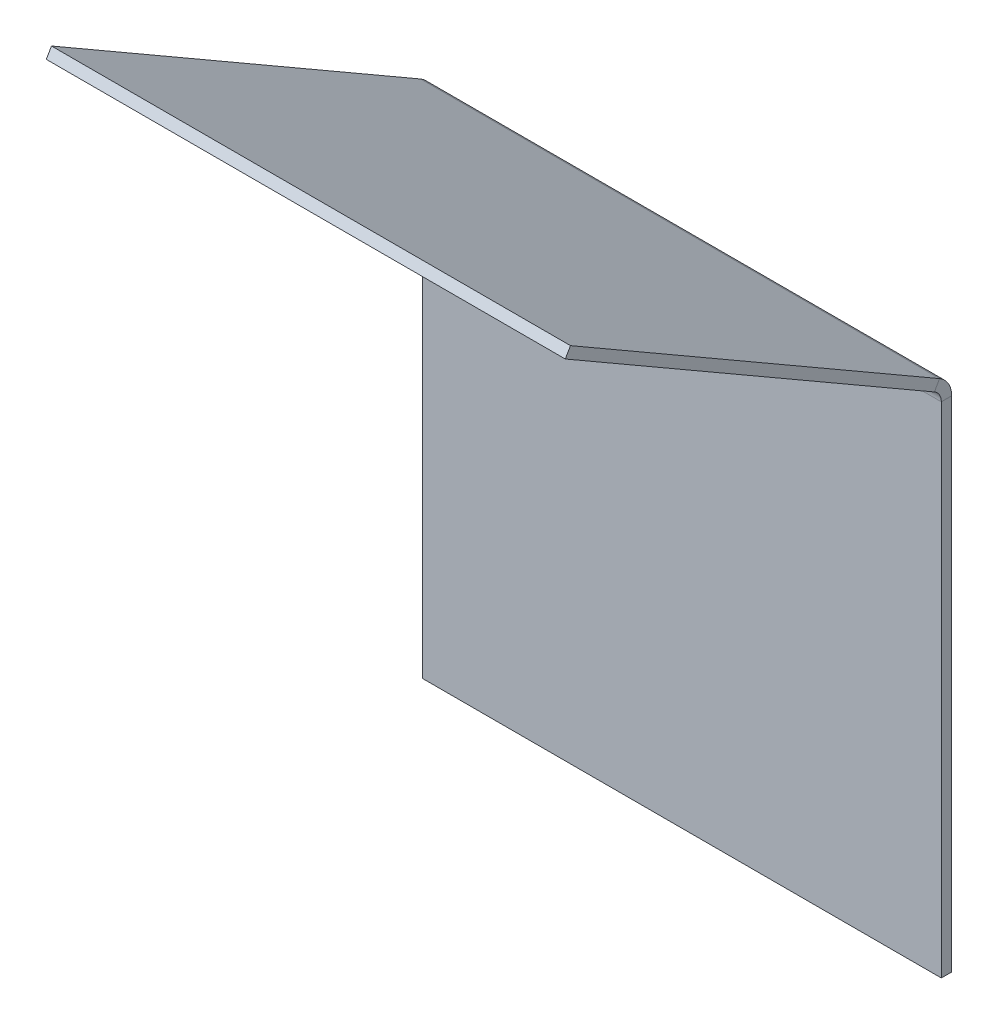
ISO-10303-21;
HEADER;
FILE_DESCRIPTION(('STEP AP214'),'2;1');
FILE_NAME('part.step','',(''),(''),'','','');
FILE_SCHEMA(('AUTOMOTIVE_DESIGN { 1 0 10303 214 1 1 1 1 }'));
ENDSEC;
DATA;
#1=APPLICATION_CONTEXT('core data for automotive mechanical design processes');
#2=APPLICATION_PROTOCOL_DEFINITION('international standard','automotive_design',2000,#1);
#3=PRODUCT_CONTEXT('',#1,'mechanical');
#4=PRODUCT('Part','Part','',(#3));
#5=PRODUCT_RELATED_PRODUCT_CATEGORY('part','',(#4));
#6=PRODUCT_DEFINITION_FORMATION('','',#4);
#7=PRODUCT_DEFINITION_CONTEXT('part definition',#1,'design');
#8=PRODUCT_DEFINITION('design','',#6,#7);
#9=PRODUCT_DEFINITION_SHAPE('','',#8);
#10=(LENGTH_UNIT() NAMED_UNIT(*) SI_UNIT(.MILLI.,.METRE.));
#11=(NAMED_UNIT(*) PLANE_ANGLE_UNIT() SI_UNIT($,.RADIAN.));
#12=(NAMED_UNIT(*) SI_UNIT($,.STERADIAN.) SOLID_ANGLE_UNIT());
#13=UNCERTAINTY_MEASURE_WITH_UNIT(LENGTH_MEASURE(1.E-05),#10,'distance_accuracy_value','');
#14=(GEOMETRIC_REPRESENTATION_CONTEXT(3) GLOBAL_UNCERTAINTY_ASSIGNED_CONTEXT((#13)) GLOBAL_UNIT_ASSIGNED_CONTEXT((#10,
#11,#12)) REPRESENTATION_CONTEXT('',''));
#15=CARTESIAN_POINT('',(0.,0.,0.));
#16=DIRECTION('',(0.,0.,1.));
#17=DIRECTION('',(1.,0.,0.));
#18=AXIS2_PLACEMENT_3D('',#15,#16,#17);
#19=CARTESIAN_POINT('',(-75.,-75.,-3.));
#20=DIRECTION('',(-1.,0.,0.));
#21=DIRECTION('',(0.,0.,1.));
#22=AXIS2_PLACEMENT_3D('',#19,#20,#21);
#23=PLANE('',#22);
#24=DIRECTION('',(0.,-1.,0.));
#25=VECTOR('',#24,1.);
#26=CARTESIAN_POINT('',(-75.,-75.,0.));
#27=LINE('',#26,#25);
#28=CARTESIAN_POINT('',(-75.,69.2264973081038,0.));
#29=VERTEX_POINT('',#28);
#30=CARTESIAN_POINT('',(-75.,-75.,0.));
#31=VERTEX_POINT('',#30);
#32=EDGE_CURVE('E105',#29,#31,#27,.T.);
#33=ORIENTED_EDGE('',*,*,#32,.F.);
#34=DIRECTION('',(0.,0.,-1.));
#35=VECTOR('',#34,1.);
#36=CARTESIAN_POINT('',(-75.,69.2264973081038,0.));
#37=LINE('',#36,#35);
#38=CARTESIAN_POINT('',(-75.,69.2264973081038,-3.00000000000001));
#39=VERTEX_POINT('',#38);
#40=EDGE_CURVE('E114',#29,#39,#37,.T.);
#41=ORIENTED_EDGE('',*,*,#40,.T.);
#42=DIRECTION('',(0.,-1.,0.));
#43=VECTOR('',#42,1.);
#44=CARTESIAN_POINT('',(-75.,-75.,-3.));
#45=LINE('',#44,#43);
#46=CARTESIAN_POINT('',(-75.,-75.,-3.));
#47=VERTEX_POINT('',#46);
#48=EDGE_CURVE('E102',#39,#47,#45,.T.);
#49=ORIENTED_EDGE('',*,*,#48,.T.);
#50=DIRECTION('',(0.,0.,1.));
#51=VECTOR('',#50,1.);
#52=CARTESIAN_POINT('',(-75.,-75.,-3.));
#53=LINE('',#52,#51);
#54=EDGE_CURVE('E60',#47,#31,#53,.T.);
#55=ORIENTED_EDGE('',*,*,#54,.T.);
#56=EDGE_LOOP('',(#33,#41,#49,#55));
#57=FACE_BOUND('',#56,.T.);
#58=ADVANCED_FACE('F57',(#57),#23,.T.);
#59=CARTESIAN_POINT('',(0.,0.,-3.));
#60=DIRECTION('',(0.,0.,1.));
#61=DIRECTION('',(1.,0.,0.));
#62=AXIS2_PLACEMENT_3D('',#59,#60,#61);
#63=PLANE('',#62);
#64=DIRECTION('',(-1.,0.,0.));
#65=VECTOR('',#64,1.);
#66=CARTESIAN_POINT('',(-75.,69.2264973081038,-3.00000000000001));
#67=LINE('',#66,#65);
#68=CARTESIAN_POINT('',(75.,69.2264973081038,-3.));
#69=VERTEX_POINT('',#68);
#70=EDGE_CURVE('E130',#39,#69,#67,.F.);
#71=ORIENTED_EDGE('',*,*,#70,.T.);
#72=DIRECTION('',(0.,1.,0.));
#73=VECTOR('',#72,1.);
#74=CARTESIAN_POINT('',(75.,-75.,-3.));
#75=LINE('',#74,#73);
#76=CARTESIAN_POINT('',(75.,-75.,-3.));
#77=VERTEX_POINT('',#76);
#78=EDGE_CURVE('E110',#77,#69,#75,.T.);
#79=ORIENTED_EDGE('',*,*,#78,.F.);
#80=DIRECTION('',(1.,0.,0.));
#81=VECTOR('',#80,1.);
#82=CARTESIAN_POINT('',(75.,-75.,-3.));
#83=LINE('',#82,#81);
#84=EDGE_CURVE('E95',#47,#77,#83,.T.);
#85=ORIENTED_EDGE('',*,*,#84,.F.);
#86=ORIENTED_EDGE('',*,*,#48,.F.);
#87=EDGE_LOOP('',(#71,#79,#85,#86));
#88=FACE_BOUND('',#87,.T.);
#89=ADVANCED_FACE('F208',(#88),#63,.F.);
#90=CARTESIAN_POINT('',(0.,0.,0.));
#91=DIRECTION('',(0.,0.,1.));
#92=DIRECTION('',(1.,0.,0.));
#93=AXIS2_PLACEMENT_3D('',#90,#91,#92);
#94=PLANE('',#93);
#95=DIRECTION('',(0.,1.,0.));
#96=VECTOR('',#95,1.);
#97=CARTESIAN_POINT('',(75.,-75.,0.));
#98=LINE('',#97,#96);
#99=CARTESIAN_POINT('',(75.,-75.,0.));
#100=VERTEX_POINT('',#99);
#101=CARTESIAN_POINT('',(75.,69.2264973081038,0.));
#102=VERTEX_POINT('',#101);
#103=EDGE_CURVE('E97',#100,#102,#98,.T.);
#104=ORIENTED_EDGE('',*,*,#103,.T.);
#105=DIRECTION('',(-1.,0.,0.));
#106=VECTOR('',#105,1.);
#107=CARTESIAN_POINT('',(-75.,69.2264973081038,0.));
#108=LINE('',#107,#106);
#109=EDGE_CURVE('E71',#29,#102,#108,.F.);
#110=ORIENTED_EDGE('',*,*,#109,.F.);
#111=ORIENTED_EDGE('',*,*,#32,.T.);
#112=DIRECTION('',(1.,0.,0.));
#113=VECTOR('',#112,1.);
#114=CARTESIAN_POINT('',(75.,-75.,0.));
#115=LINE('',#114,#113);
#116=EDGE_CURVE('E93',#31,#100,#115,.T.);
#117=ORIENTED_EDGE('',*,*,#116,.T.);
#118=EDGE_LOOP('',(#104,#110,#111,#117));
#119=FACE_BOUND('',#118,.T.);
#120=ADVANCED_FACE('F104',(#119),#94,.T.);
#121=CARTESIAN_POINT('',(75.,-75.,-3.));
#122=DIRECTION('',(1.,0.,0.));
#123=DIRECTION('',(0.,0.,-1.));
#124=AXIS2_PLACEMENT_3D('',#121,#122,#123);
#125=PLANE('',#124);
#126=DIRECTION('',(0.,0.,-1.));
#127=VECTOR('',#126,1.);
#128=CARTESIAN_POINT('',(75.,69.2264973081038,0.));
#129=LINE('',#128,#127);
#130=EDGE_CURVE('E101',#102,#69,#129,.T.);
#131=ORIENTED_EDGE('',*,*,#130,.F.);
#132=ORIENTED_EDGE('',*,*,#103,.F.);
#133=DIRECTION('',(0.,0.,1.));
#134=VECTOR('',#133,1.);
#135=CARTESIAN_POINT('',(75.,-75.,-3.));
#136=LINE('',#135,#134);
#137=EDGE_CURVE('E13',#77,#100,#136,.T.);
#138=ORIENTED_EDGE('',*,*,#137,.F.);
#139=ORIENTED_EDGE('',*,*,#78,.T.);
#140=EDGE_LOOP('',(#131,#132,#138,#139));
#141=FACE_BOUND('',#140,.T.);
#142=ADVANCED_FACE('F98',(#141),#125,.T.);
#143=CARTESIAN_POINT('',(75.,-75.,-3.));
#144=DIRECTION('',(0.,-1.,0.));
#145=DIRECTION('',(1.,0.,0.));
#146=AXIS2_PLACEMENT_3D('',#143,#144,#145);
#147=PLANE('',#146);
#148=ORIENTED_EDGE('',*,*,#116,.F.);
#149=ORIENTED_EDGE('',*,*,#54,.F.);
#150=ORIENTED_EDGE('',*,*,#84,.T.);
#151=ORIENTED_EDGE('',*,*,#137,.T.);
#152=EDGE_LOOP('',(#148,#149,#150,#151));
#153=FACE_BOUND('',#152,.T.);
#154=ADVANCED_FACE('F90',(#153),#147,.T.);
#155=CARTESIAN_POINT('',(75.,69.2264973081038,3.99999999999998));
#156=DIRECTION('',(1.,0.,0.));
#157=DIRECTION('',(0.,0.,-1.));
#158=AXIS2_PLACEMENT_3D('',#155,#156,#157);
#159=PLANE('',#158);
#160=DIRECTION('',(0.,-0.866025403784436,0.500000000000004));
#161=VECTOR('',#160,1.);
#162=CARTESIAN_POINT('',(75.,75.2886751345948,0.499999999999972));
#163=LINE('',#162,#161);
#164=CARTESIAN_POINT('',(75.,72.6905989232415,1.99999999999997));
#165=VERTEX_POINT('',#164);
#166=CARTESIAN_POINT('',(75.,75.2886751345948,0.499999999999956));
#167=VERTEX_POINT('',#166);
#168=EDGE_CURVE('E135',#165,#167,#163,.F.);
#169=ORIENTED_EDGE('',*,*,#168,.F.);
#170=CARTESIAN_POINT('',(75.,69.2264973081038,3.99999999999998));
#171=DIRECTION('',(-1.,0.,0.));
#172=DIRECTION('',(0.,0.,1.));
#173=AXIS2_PLACEMENT_3D('',#170,#171,#172);
#174=CIRCLE('',#173,3.99999999999999);
#175=EDGE_CURVE('E124',#102,#165,#174,.F.);
#176=ORIENTED_EDGE('',*,*,#175,.F.);
#177=ORIENTED_EDGE('',*,*,#130,.T.);
#178=CARTESIAN_POINT('',(75.,69.2264973081038,3.99999999999998));
#179=DIRECTION('',(-1.,0.,0.));
#180=DIRECTION('',(0.,0.,1.));
#181=AXIS2_PLACEMENT_3D('',#178,#179,#180);
#182=CIRCLE('',#181,6.99999999999999);
#183=EDGE_CURVE('E117',#69,#167,#182,.F.);
#184=ORIENTED_EDGE('',*,*,#183,.T.);
#185=EDGE_LOOP('',(#169,#176,#177,#184));
#186=FACE_BOUND('',#185,.T.);
#187=ADVANCED_FACE('F212',(#186),#159,.T.);
#188=CARTESIAN_POINT('',(-75.,69.2264973081038,3.99999999999998));
#189=DIRECTION('',(1.,0.,0.));
#190=DIRECTION('',(0.,0.,-1.));
#191=AXIS2_PLACEMENT_3D('',#188,#189,#190);
#192=PLANE('',#191);
#193=CARTESIAN_POINT('',(-75.,69.2264973081038,3.99999999999998));
#194=DIRECTION('',(-1.,0.,0.));
#195=DIRECTION('',(0.,0.,1.));
#196=AXIS2_PLACEMENT_3D('',#193,#194,#195);
#197=CIRCLE('',#196,3.99999999999999);
#198=CARTESIAN_POINT('',(-75.,72.6905989232415,1.99999999999997));
#199=VERTEX_POINT('',#198);
#200=EDGE_CURVE('E119',#199,#29,#197,.T.);
#201=ORIENTED_EDGE('',*,*,#200,.F.);
#202=DIRECTION('',(0.,-0.866025403784436,0.500000000000004));
#203=VECTOR('',#202,1.);
#204=CARTESIAN_POINT('',(-75.,72.6905989232415,2.));
#205=LINE('',#204,#203);
#206=CARTESIAN_POINT('',(-75.,75.2886751345948,0.49999999999996));
#207=VERTEX_POINT('',#206);
#208=EDGE_CURVE('E141',#199,#207,#205,.F.);
#209=ORIENTED_EDGE('',*,*,#208,.T.);
#210=CARTESIAN_POINT('',(-75.,69.2264973081038,3.99999999999998));
#211=DIRECTION('',(-1.,0.,0.));
#212=DIRECTION('',(0.,0.,1.));
#213=AXIS2_PLACEMENT_3D('',#210,#211,#212);
#214=CIRCLE('',#213,6.99999999999999);
#215=EDGE_CURVE('E127',#207,#39,#214,.T.);
#216=ORIENTED_EDGE('',*,*,#215,.T.);
#217=ORIENTED_EDGE('',*,*,#40,.F.);
#218=EDGE_LOOP('',(#201,#209,#216,#217));
#219=FACE_BOUND('',#218,.T.);
#220=ADVANCED_FACE('F222',(#219),#192,.F.);
#221=CARTESIAN_POINT('',(-75.,69.2264973081038,3.99999999999998));
#222=DIRECTION('',(-1.,0.,0.));
#223=DIRECTION('',(0.,0.866025403784436,-0.500000000000004));
#224=AXIS2_PLACEMENT_3D('',#221,#222,#223);
#225=CYLINDRICAL_SURFACE('',#224,6.99999999999999);
#226=ORIENTED_EDGE('',*,*,#70,.F.);
#227=ORIENTED_EDGE('',*,*,#215,.F.);
#228=DIRECTION('',(-1.,0.,0.));
#229=VECTOR('',#228,1.);
#230=CARTESIAN_POINT('',(75.,75.2886751345948,0.499999999999962));
#231=LINE('',#230,#229);
#232=EDGE_CURVE('E144',#207,#167,#231,.F.);
#233=ORIENTED_EDGE('',*,*,#232,.T.);
#234=ORIENTED_EDGE('',*,*,#183,.F.);
#235=EDGE_LOOP('',(#226,#227,#233,#234));
#236=FACE_BOUND('',#235,.T.);
#237=ADVANCED_FACE('F213',(#236),#225,.T.);
#238=CARTESIAN_POINT('',(-75.,69.2264973081038,3.99999999999998));
#239=DIRECTION('',(-1.,0.,0.));
#240=DIRECTION('',(0.,0.866025403784436,-0.500000000000004));
#241=AXIS2_PLACEMENT_3D('',#238,#239,#240);
#242=CYLINDRICAL_SURFACE('',#241,3.99999999999999);
#243=ORIENTED_EDGE('',*,*,#109,.T.);
#244=ORIENTED_EDGE('',*,*,#175,.T.);
#245=DIRECTION('',(-1.,0.,0.));
#246=VECTOR('',#245,1.);
#247=CARTESIAN_POINT('',(75.,72.6905989232415,1.99999999999997));
#248=LINE('',#247,#246);
#249=EDGE_CURVE('E138',#165,#199,#248,.T.);
#250=ORIENTED_EDGE('',*,*,#249,.T.);
#251=ORIENTED_EDGE('',*,*,#200,.T.);
#252=EDGE_LOOP('',(#243,#244,#250,#251));
#253=FACE_BOUND('',#252,.T.);
#254=ADVANCED_FACE('F225',(#253),#242,.F.);
#255=CARTESIAN_POINT('',(75.,74.1339745962155,-1.50000000000001));
#256=DIRECTION('',(-1.,0.,0.));
#257=DIRECTION('',(0.,0.,1.));
#258=AXIS2_PLACEMENT_3D('',#255,#256,#257);
#259=PLANE('',#258);
#260=ORIENTED_EDGE('',*,*,#168,.T.);
#261=DIRECTION('',(0.,-0.500000000000004,-0.866025403784436));
#262=VECTOR('',#261,1.);
#263=CARTESIAN_POINT('',(75.,55.3839745962153,-33.9759526419166));
#264=LINE('',#263,#262);
#265=CARTESIAN_POINT('',(75.,136.883974596216,107.186188174947));
#266=VERTEX_POINT('',#265);
#267=EDGE_CURVE('E156',#266,#167,#264,.T.);
#268=ORIENTED_EDGE('',*,*,#267,.F.);
#269=DIRECTION('',(0.,-0.866025403784436,0.500000000000004));
#270=VECTOR('',#269,1.);
#271=CARTESIAN_POINT('',(75.,136.883974596216,107.186188174947));
#272=LINE('',#271,#270);
#273=CARTESIAN_POINT('',(75.,134.285898384863,108.686188174947));
#274=VERTEX_POINT('',#273);
#275=EDGE_CURVE('E165',#266,#274,#272,.T.);
#276=ORIENTED_EDGE('',*,*,#275,.T.);
#277=DIRECTION('',(0.,0.500000000000004,0.866025403784436));
#278=VECTOR('',#277,1.);
#279=CARTESIAN_POINT('',(75.,71.5358983848623,0.));
#280=LINE('',#279,#278);
#281=EDGE_CURVE('E147',#274,#165,#280,.F.);
#282=ORIENTED_EDGE('',*,*,#281,.T.);
#283=EDGE_LOOP('',(#260,#268,#276,#282));
#284=FACE_BOUND('',#283,.T.);
#285=ADVANCED_FACE('F191',(#284),#259,.F.);
#286=CARTESIAN_POINT('',(-75.,136.883974596216,107.186188174947));
#287=DIRECTION('',(1.,0.,0.));
#288=DIRECTION('',(0.,0.,-1.));
#289=AXIS2_PLACEMENT_3D('',#286,#287,#288);
#290=PLANE('',#289);
#291=ORIENTED_EDGE('',*,*,#208,.F.);
#292=DIRECTION('',(0.,-0.500000000000004,-0.866025403784436));
#293=VECTOR('',#292,1.);
#294=CARTESIAN_POINT('',(-75.,134.285898384863,108.686188174947));
#295=LINE('',#294,#293);
#296=CARTESIAN_POINT('',(-75.,134.285898384863,108.686188174947));
#297=VERTEX_POINT('',#296);
#298=EDGE_CURVE('E150',#199,#297,#295,.F.);
#299=ORIENTED_EDGE('',*,*,#298,.T.);
#300=DIRECTION('',(0.,-0.866025403784436,0.500000000000004));
#301=VECTOR('',#300,1.);
#302=CARTESIAN_POINT('',(-75.,136.883974596216,107.186188174947));
#303=LINE('',#302,#301);
#304=CARTESIAN_POINT('',(-75.,136.883974596216,107.186188174947));
#305=VERTEX_POINT('',#304);
#306=EDGE_CURVE('E122',#305,#297,#303,.T.);
#307=ORIENTED_EDGE('',*,*,#306,.F.);
#308=DIRECTION('',(0.,0.500000000000004,0.866025403784436));
#309=VECTOR('',#308,1.);
#310=CARTESIAN_POINT('',(-75.,55.3839745962153,-33.9759526419166));
#311=LINE('',#310,#309);
#312=EDGE_CURVE('E159',#207,#305,#311,.T.);
#313=ORIENTED_EDGE('',*,*,#312,.F.);
#314=EDGE_LOOP('',(#291,#299,#307,#313));
#315=FACE_BOUND('',#314,.T.);
#316=ADVANCED_FACE('F219',(#315),#290,.F.);
#317=CARTESIAN_POINT('',(0.,55.3839745962153,-33.9759526419166));
#318=DIRECTION('',(0.,-0.866025403784436,0.500000000000004));
#319=DIRECTION('',(0.,-0.500000000000004,-0.866025403784436));
#320=AXIS2_PLACEMENT_3D('',#317,#318,#319);
#321=PLANE('',#320);
#322=ORIENTED_EDGE('',*,*,#232,.F.);
#323=ORIENTED_EDGE('',*,*,#312,.T.);
#324=DIRECTION('',(1.,0.,0.));
#325=VECTOR('',#324,1.);
#326=CARTESIAN_POINT('',(0.,136.883974596216,107.186188174947));
#327=LINE('',#326,#325);
#328=EDGE_CURVE('E162',#305,#266,#327,.T.);
#329=ORIENTED_EDGE('',*,*,#328,.T.);
#330=ORIENTED_EDGE('',*,*,#267,.T.);
#331=EDGE_LOOP('',(#322,#323,#329,#330));
#332=FACE_BOUND('',#331,.T.);
#333=ADVANCED_FACE('F216',(#332),#321,.F.);
#334=CARTESIAN_POINT('',(0.,52.7858983848619,-32.4759526419166));
#335=DIRECTION('',(0.,-0.866025403784436,0.500000000000004));
#336=DIRECTION('',(0.,-0.500000000000004,-0.866025403784436));
#337=AXIS2_PLACEMENT_3D('',#334,#335,#336);
#338=PLANE('',#337);
#339=ORIENTED_EDGE('',*,*,#298,.F.);
#340=ORIENTED_EDGE('',*,*,#249,.F.);
#341=ORIENTED_EDGE('',*,*,#281,.F.);
#342=DIRECTION('',(-1.,0.,0.));
#343=VECTOR('',#342,1.);
#344=CARTESIAN_POINT('',(75.,134.285898384863,108.686188174947));
#345=LINE('',#344,#343);
#346=EDGE_CURVE('E153',#297,#274,#345,.F.);
#347=ORIENTED_EDGE('',*,*,#346,.F.);
#348=EDGE_LOOP('',(#339,#340,#341,#347));
#349=FACE_BOUND('',#348,.T.);
#350=ADVANCED_FACE('F185',(#349),#338,.T.);
#351=CARTESIAN_POINT('',(75.,136.883974596216,107.186188174947));
#352=DIRECTION('',(0.,-0.500000000000004,-0.866025403784436));
#353=DIRECTION('',(0.,0.866025403784436,-0.500000000000004));
#354=AXIS2_PLACEMENT_3D('',#351,#352,#353);
#355=PLANE('',#354);
#356=ORIENTED_EDGE('',*,*,#346,.T.);
#357=ORIENTED_EDGE('',*,*,#275,.F.);
#358=ORIENTED_EDGE('',*,*,#328,.F.);
#359=ORIENTED_EDGE('',*,*,#306,.T.);
#360=EDGE_LOOP('',(#356,#357,#358,#359));
#361=FACE_BOUND('',#360,.T.);
#362=ADVANCED_FACE('F174',(#361),#355,.F.);
#363=CLOSED_SHELL('',(#58,#89,#120,#142,#154,#187,#220,#237,#254,#285,#316,#333,#350,#362));
#364=MANIFOLD_SOLID_BREP('B2',#363);
#365=ADVANCED_BREP_SHAPE_REPRESENTATION('',(#18,#364),#14);
#366=SHAPE_DEFINITION_REPRESENTATION(#9,#365);
ENDSEC;
END-ISO-10303-21;
